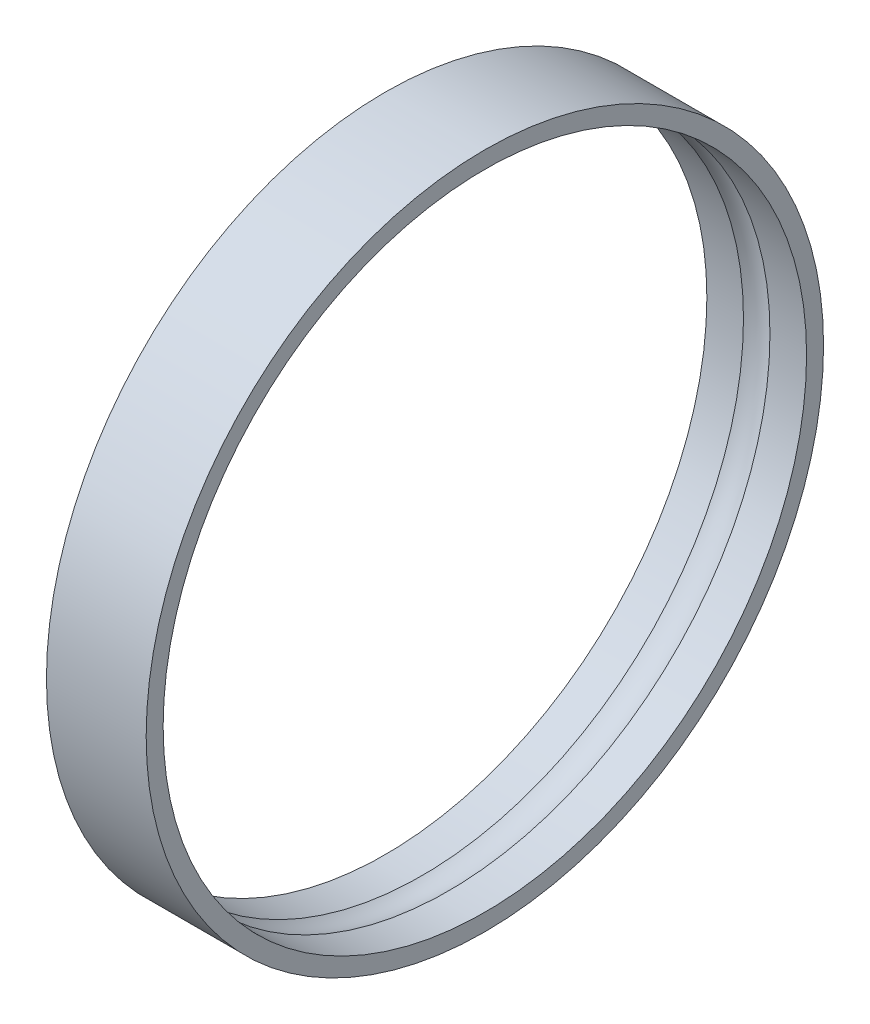
ISO-10303-21;
HEADER;
FILE_DESCRIPTION(('STEP AP214'),'2;1');
FILE_NAME('part.step','',(''),(''),'','','');
FILE_SCHEMA(('AUTOMOTIVE_DESIGN { 1 0 10303 214 1 1 1 1 }'));
ENDSEC;
DATA;
#1=APPLICATION_CONTEXT('core data for automotive mechanical design processes');
#2=APPLICATION_PROTOCOL_DEFINITION('international standard','automotive_design',2000,#1);
#3=PRODUCT_CONTEXT('',#1,'mechanical');
#4=PRODUCT('Part','Part','',(#3));
#5=PRODUCT_RELATED_PRODUCT_CATEGORY('part','',(#4));
#6=PRODUCT_DEFINITION_FORMATION('','',#4);
#7=PRODUCT_DEFINITION_CONTEXT('part definition',#1,'design');
#8=PRODUCT_DEFINITION('design','',#6,#7);
#9=PRODUCT_DEFINITION_SHAPE('','',#8);
#10=(LENGTH_UNIT() NAMED_UNIT(*) SI_UNIT(.MILLI.,.METRE.));
#11=(NAMED_UNIT(*) PLANE_ANGLE_UNIT() SI_UNIT($,.RADIAN.));
#12=(NAMED_UNIT(*) SI_UNIT($,.STERADIAN.) SOLID_ANGLE_UNIT());
#13=UNCERTAINTY_MEASURE_WITH_UNIT(LENGTH_MEASURE(1.E-05),#10,'distance_accuracy_value','');
#14=(GEOMETRIC_REPRESENTATION_CONTEXT(3) GLOBAL_UNCERTAINTY_ASSIGNED_CONTEXT((#13)) GLOBAL_UNIT_ASSIGNED_CONTEXT((#10,
#11,#12)) REPRESENTATION_CONTEXT('',''));
#15=CARTESIAN_POINT('',(0.,0.,0.));
#16=DIRECTION('',(0.,0.,1.));
#17=DIRECTION('',(1.,0.,0.));
#18=AXIS2_PLACEMENT_3D('',#15,#16,#17);
#19=CARTESIAN_POINT('',(64.16,0.,0.));
#20=DIRECTION('',(1.,0.,0.));
#21=DIRECTION('',(0.,0.,-1.));
#22=AXIS2_PLACEMENT_3D('',#19,#20,#21);
#23=TOROIDAL_SURFACE('',#22,69.3830000000004,7.15);
#24=CARTESIAN_POINT('',(61.0392611451773,0.,0.));
#25=DIRECTION('',(-1.,0.,0.));
#26=DIRECTION('',(0.,0.,1.00000000000001));
#27=AXIS2_PLACEMENT_3D('',#24,#25,#26);
#28=CIRCLE('',#27,75.816);
#29=CARTESIAN_POINT('',(61.0392611451773,0.,75.8160000000005));
#30=VERTEX_POINT('',#29);
#31=EDGE_CURVE('E38',#30,#30,#28,.T.);
#32=ORIENTED_EDGE('',*,*,#31,.T.);
#33=EDGE_LOOP('',(#32));
#34=FACE_BOUND('',#33,.T.);
#35=CARTESIAN_POINT('',(67.2807388548227,0.,0.));
#36=DIRECTION('',(-1.,0.,0.));
#37=DIRECTION('',(0.,0.,1.00000000000001));
#38=AXIS2_PLACEMENT_3D('',#35,#36,#37);
#39=CIRCLE('',#38,75.816);
#40=CARTESIAN_POINT('',(67.2807388548227,0.,75.8160000000005));
#41=VERTEX_POINT('',#40);
#42=EDGE_CURVE('E43',#41,#41,#39,.F.);
#43=ORIENTED_EDGE('',*,*,#42,.T.);
#44=EDGE_LOOP('',(#43));
#45=FACE_BOUND('',#44,.T.);
#46=ADVANCED_FACE('F22',(#34,#45),#23,.F.);
#47=CARTESIAN_POINT('',(64.16,0.,0.));
#48=DIRECTION('',(-1.,0.,0.));
#49=DIRECTION('',(0.,0.,1.00000000000001));
#50=AXIS2_PLACEMENT_3D('',#47,#48,#49);
#51=CYLINDRICAL_SURFACE('',#50,75.816);
#52=CARTESIAN_POINT('',(52.41,0.,0.));
#53=DIRECTION('',(-1.,0.,0.));
#54=DIRECTION('',(0.,0.,1.00000000000001));
#55=AXIS2_PLACEMENT_3D('',#52,#53,#54);
#56=CIRCLE('',#55,75.816);
#57=CARTESIAN_POINT('',(52.41,0.,75.8160000000005));
#58=VERTEX_POINT('',#57);
#59=EDGE_CURVE('E26',#58,#58,#56,.F.);
#60=ORIENTED_EDGE('',*,*,#59,.F.);
#61=EDGE_LOOP('',(#60));
#62=FACE_BOUND('',#61,.T.);
#63=ORIENTED_EDGE('',*,*,#31,.F.);
#64=EDGE_LOOP('',(#63));
#65=FACE_BOUND('',#64,.T.);
#66=ADVANCED_FACE('F55',(#62,#65),#51,.F.);
#67=CARTESIAN_POINT('',(64.16,0.,0.));
#68=DIRECTION('',(-1.,0.,0.));
#69=DIRECTION('',(0.,0.,1.00000000000001));
#70=AXIS2_PLACEMENT_3D('',#67,#68,#69);
#71=CYLINDRICAL_SURFACE('',#70,75.816);
#72=ORIENTED_EDGE('',*,*,#42,.F.);
#73=EDGE_LOOP('',(#72));
#74=FACE_BOUND('',#73,.T.);
#75=CARTESIAN_POINT('',(75.91,0.,0.));
#76=DIRECTION('',(-1.,0.,0.));
#77=DIRECTION('',(0.,0.,1.00000000000001));
#78=AXIS2_PLACEMENT_3D('',#75,#76,#77);
#79=CIRCLE('',#78,75.816);
#80=CARTESIAN_POINT('',(75.91,0.,75.8160000000005));
#81=VERTEX_POINT('',#80);
#82=EDGE_CURVE('E35',#81,#81,#79,.T.);
#83=ORIENTED_EDGE('',*,*,#82,.F.);
#84=EDGE_LOOP('',(#83));
#85=FACE_BOUND('',#84,.T.);
#86=ADVANCED_FACE('F57',(#74,#85),#71,.F.);
#87=CARTESIAN_POINT('',(52.41,0.,77.8160000000004));
#88=DIRECTION('',(-1.,0.,0.));
#89=DIRECTION('',(0.,0.,1.00000000000001));
#90=AXIS2_PLACEMENT_3D('',#87,#88,#89);
#91=PLANE('',#90);
#92=ORIENTED_EDGE('',*,*,#59,.T.);
#93=EDGE_LOOP('',(#92));
#94=FACE_BOUND('',#93,.T.);
#95=CARTESIAN_POINT('',(52.41,0.,0.));
#96=DIRECTION('',(-1.,0.,0.));
#97=DIRECTION('',(0.,0.,1.00000000000001));
#98=AXIS2_PLACEMENT_3D('',#95,#96,#97);
#99=CIRCLE('',#98,79.816);
#100=CARTESIAN_POINT('',(52.41,0.,79.8160000000005));
#101=VERTEX_POINT('',#100);
#102=EDGE_CURVE('E30',#101,#101,#99,.F.);
#103=ORIENTED_EDGE('',*,*,#102,.F.);
#104=EDGE_LOOP('',(#103));
#105=FACE_BOUND('',#104,.T.);
#106=ADVANCED_FACE('F64',(#94,#105),#91,.T.);
#107=CARTESIAN_POINT('',(75.91,0.,77.8160000000004));
#108=DIRECTION('',(1.,0.,0.));
#109=DIRECTION('',(0.,0.,-1.00000000000001));
#110=AXIS2_PLACEMENT_3D('',#107,#108,#109);
#111=PLANE('',#110);
#112=CARTESIAN_POINT('',(75.91,0.,0.));
#113=DIRECTION('',(-1.,0.,0.));
#114=DIRECTION('',(0.,0.,1.00000000000001));
#115=AXIS2_PLACEMENT_3D('',#112,#113,#114);
#116=CIRCLE('',#115,79.816);
#117=CARTESIAN_POINT('',(75.91,0.,79.8160000000005));
#118=VERTEX_POINT('',#117);
#119=EDGE_CURVE('E12',#118,#118,#116,.T.);
#120=ORIENTED_EDGE('',*,*,#119,.F.);
#121=EDGE_LOOP('',(#120));
#122=FACE_BOUND('',#121,.T.);
#123=ORIENTED_EDGE('',*,*,#82,.T.);
#124=EDGE_LOOP('',(#123));
#125=FACE_BOUND('',#124,.T.);
#126=ADVANCED_FACE('F69',(#122,#125),#111,.T.);
#127=CARTESIAN_POINT('',(64.16,0.,0.));
#128=DIRECTION('',(-1.,0.,0.));
#129=DIRECTION('',(0.,0.,1.00000000000001));
#130=AXIS2_PLACEMENT_3D('',#127,#128,#129);
#131=CYLINDRICAL_SURFACE('',#130,79.816);
#132=ORIENTED_EDGE('',*,*,#102,.T.);
#133=EDGE_LOOP('',(#132));
#134=FACE_BOUND('',#133,.T.);
#135=ORIENTED_EDGE('',*,*,#119,.T.);
#136=EDGE_LOOP('',(#135));
#137=FACE_BOUND('',#136,.T.);
#138=ADVANCED_FACE('F67',(#134,#137),#131,.T.);
#139=CLOSED_SHELL('',(#46,#66,#86,#106,#126,#138));
#140=MANIFOLD_SOLID_BREP('B1',#139);
#141=ADVANCED_BREP_SHAPE_REPRESENTATION('',(#18,#140),#14);
#142=SHAPE_DEFINITION_REPRESENTATION(#9,#141);
ENDSEC;
END-ISO-10303-21;
